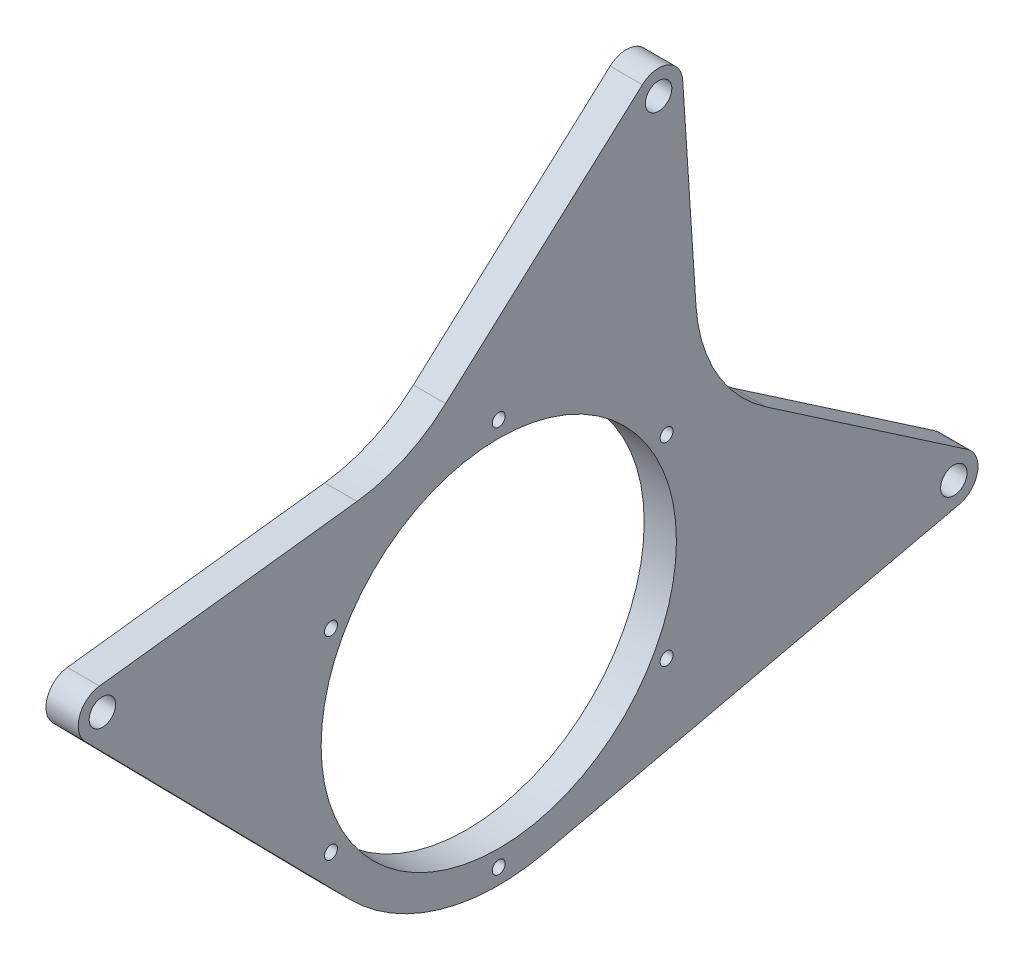
ISO-10303-21;
HEADER;
FILE_DESCRIPTION(('STEP AP214'),'2;1');
FILE_NAME('part.step','',(''),(''),'','','');
FILE_SCHEMA(('AUTOMOTIVE_DESIGN { 1 0 10303 214 1 1 1 1 }'));
ENDSEC;
DATA;
#1=APPLICATION_CONTEXT('core data for automotive mechanical design processes');
#2=APPLICATION_PROTOCOL_DEFINITION('international standard','automotive_design',2000,#1);
#3=PRODUCT_CONTEXT('',#1,'mechanical');
#4=PRODUCT('Part','Part','',(#3));
#5=PRODUCT_RELATED_PRODUCT_CATEGORY('part','',(#4));
#6=PRODUCT_DEFINITION_FORMATION('','',#4);
#7=PRODUCT_DEFINITION_CONTEXT('part definition',#1,'design');
#8=PRODUCT_DEFINITION('design','',#6,#7);
#9=PRODUCT_DEFINITION_SHAPE('','',#8);
#10=(LENGTH_UNIT() NAMED_UNIT(*) SI_UNIT(.MILLI.,.METRE.));
#11=(NAMED_UNIT(*) PLANE_ANGLE_UNIT() SI_UNIT($,.RADIAN.));
#12=(NAMED_UNIT(*) SI_UNIT($,.STERADIAN.) SOLID_ANGLE_UNIT());
#13=UNCERTAINTY_MEASURE_WITH_UNIT(LENGTH_MEASURE(1.E-05),#10,'distance_accuracy_value','');
#14=(GEOMETRIC_REPRESENTATION_CONTEXT(3) GLOBAL_UNCERTAINTY_ASSIGNED_CONTEXT((#13)) GLOBAL_UNIT_ASSIGNED_CONTEXT((#10,
#11,#12)) REPRESENTATION_CONTEXT('',''));
#15=CARTESIAN_POINT('',(0.,0.,0.));
#16=DIRECTION('',(0.,0.,1.));
#17=DIRECTION('',(1.,0.,0.));
#18=AXIS2_PLACEMENT_3D('',#15,#16,#17);
#19=CARTESIAN_POINT('',(-8.35,-19.0009562450486,-4.33392395499701));
#20=DIRECTION('',(0.,0.97496040935678,0.222378506575748));
#21=DIRECTION('',(0.,-0.222378506575748,0.97496040935678));
#22=AXIS2_PLACEMENT_3D('',#19,#20,#21);
#23=PLANE('',#22);
#24=DIRECTION('',(0.,-0.222378506575748,0.97496040935678));
#25=VECTOR('',#24,1.);
#26=CARTESIAN_POINT('',(1.65,-19.0009562450486,-4.33392395499701));
#27=LINE('',#26,#25);
#28=CARTESIAN_POINT('',(1.65,266.919395505318,-1257.87693707447));
#29=VERTEX_POINT('',#28);
#30=CARTESIAN_POINT('',(1.65,237.627573391809,-1129.45460292742));
#31=VERTEX_POINT('',#30);
#32=EDGE_CURVE('E167',#29,#31,#27,.T.);
#33=ORIENTED_EDGE('',*,*,#32,.T.);
#34=DIRECTION('',(1.,0.,0.));
#35=VECTOR('',#34,1.);
#36=CARTESIAN_POINT('',(-8.35,237.627573391809,-1129.45460292742));
#37=LINE('',#36,#35);
#38=CARTESIAN_POINT('',(-8.35,237.627573391809,-1129.45460292742));
#39=VERTEX_POINT('',#38);
#40=EDGE_CURVE('E146',#39,#31,#37,.T.);
#41=ORIENTED_EDGE('',*,*,#40,.F.);
#42=DIRECTION('',(0.,-0.222378506575748,0.97496040935678));
#43=VECTOR('',#42,1.);
#44=CARTESIAN_POINT('',(-8.35,-19.0009562450486,-4.33392395499701));
#45=LINE('',#44,#43);
#46=CARTESIAN_POINT('',(-8.35,266.919395505318,-1257.87693707447));
#47=VERTEX_POINT('',#46);
#48=EDGE_CURVE('E153',#47,#39,#45,.T.);
#49=ORIENTED_EDGE('',*,*,#48,.F.);
#50=DIRECTION('',(1.,0.,0.));
#51=VECTOR('',#50,1.);
#52=CARTESIAN_POINT('',(-8.35,266.919395505318,-1257.87693707447));
#53=LINE('',#52,#51);
#54=EDGE_CURVE('E234',#47,#29,#53,.T.);
#55=ORIENTED_EDGE('',*,*,#54,.T.);
#56=EDGE_LOOP('',(#33,#41,#49,#55));
#57=FACE_BOUND('',#56,.T.);
#58=ADVANCED_FACE('F52',(#57),#23,.F.);
#59=CARTESIAN_POINT('',(-8.35,301.,-1115.));
#60=DIRECTION('',(1.,0.,0.));
#61=DIRECTION('',(0.,0.,-1.));
#62=AXIS2_PLACEMENT_3D('',#59,#60,#61);
#63=CYLINDRICAL_SURFACE('',#62,64.9999999999999);
#64=CARTESIAN_POINT('',(1.65,301.,-1115.));
#65=DIRECTION('',(-1.,0.,0.));
#66=DIRECTION('',(0.,0.,1.));
#67=AXIS2_PLACEMENT_3D('',#64,#65,#66);
#68=CIRCLE('',#67,64.9999999999999);
#69=CARTESIAN_POINT('',(1.65,255.416880135259,-1068.66233515382));
#70=VERTEX_POINT('',#69);
#71=EDGE_CURVE('E251',#31,#70,#68,.T.);
#72=ORIENTED_EDGE('',*,*,#71,.T.);
#73=DIRECTION('',(1.,0.,0.));
#74=VECTOR('',#73,1.);
#75=CARTESIAN_POINT('',(-8.35,255.416880135259,-1068.66233515382));
#76=LINE('',#75,#74);
#77=CARTESIAN_POINT('',(-8.35,255.416880135259,-1068.66233515382));
#78=VERTEX_POINT('',#77);
#79=EDGE_CURVE('E148',#78,#70,#76,.T.);
#80=ORIENTED_EDGE('',*,*,#79,.F.);
#81=CARTESIAN_POINT('',(-8.35,301.,-1115.));
#82=DIRECTION('',(-1.,0.,0.));
#83=DIRECTION('',(0.,0.,1.));
#84=AXIS2_PLACEMENT_3D('',#81,#82,#83);
#85=CIRCLE('',#84,64.9999999999999);
#86=EDGE_CURVE('E141',#39,#78,#85,.T.);
#87=ORIENTED_EDGE('',*,*,#86,.F.);
#88=ORIENTED_EDGE('',*,*,#40,.T.);
#89=EDGE_LOOP('',(#72,#80,#87,#88));
#90=FACE_BOUND('',#89,.T.);
#91=ADVANCED_FACE('F144',(#90),#63,.T.);
#92=CARTESIAN_POINT('',(-8.35,659.871119138972,-670.794075768932));
#93=DIRECTION('',(0.,-0.701278767149864,0.712887151479648));
#94=DIRECTION('',(0.,-0.712887151479648,-0.701278767149864));
#95=AXIS2_PLACEMENT_3D('',#92,#93,#94);
#96=PLANE('',#95);
#97=DIRECTION('',(0.,-0.712887151479648,-0.701278767149864));
#98=VECTOR('',#97,1.);
#99=CARTESIAN_POINT('',(1.65,659.871119138972,-670.794075768932));
#100=LINE('',#99,#98);
#101=CARTESIAN_POINT('',(1.65,338.79410160127,-986.642796778492));
#102=VERTEX_POINT('',#101);
#103=EDGE_CURVE('E221',#102,#70,#100,.T.);
#104=ORIENTED_EDGE('',*,*,#103,.F.);
#105=DIRECTION('',(1.,0.,0.));
#106=VECTOR('',#105,1.);
#107=CARTESIAN_POINT('',(-8.35,338.79410160127,-986.642796778492));
#108=LINE('',#107,#106);
#109=CARTESIAN_POINT('',(-8.35,338.79410160127,-986.642796778492));
#110=VERTEX_POINT('',#109);
#111=EDGE_CURVE('E173',#110,#102,#108,.T.);
#112=ORIENTED_EDGE('',*,*,#111,.F.);
#113=DIRECTION('',(0.,-0.712887151479648,-0.701278767149864));
#114=VECTOR('',#113,1.);
#115=CARTESIAN_POINT('',(-8.35,659.871119138972,-670.794075768932));
#116=LINE('',#115,#114);
#117=EDGE_CURVE('E152',#110,#78,#116,.T.);
#118=ORIENTED_EDGE('',*,*,#117,.T.);
#119=ORIENTED_EDGE('',*,*,#79,.T.);
#120=EDGE_LOOP('',(#104,#112,#118,#119));
#121=FACE_BOUND('',#120,.T.);
#122=ADVANCED_FACE('F250',(#121),#96,.T.);
#123=CARTESIAN_POINT('',(-8.35,344.053692354894,-991.989450414589));
#124=DIRECTION('',(1.,0.,0.));
#125=DIRECTION('',(0.,0.,-1.));
#126=AXIS2_PLACEMENT_3D('',#123,#124,#125);
#127=CYLINDRICAL_SURFACE('',#126,7.49999999999996);
#128=CARTESIAN_POINT('',(1.65,344.053692354894,-991.989450414589));
#129=DIRECTION('',(-1.,0.,0.));
#130=DIRECTION('',(0.,0.,1.));
#131=AXIS2_PLACEMENT_3D('',#128,#129,#130);
#132=CIRCLE('',#131,7.49999999999996);
#133=CARTESIAN_POINT('',(1.65,351.499526146942,-991.089695369476));
#134=VERTEX_POINT('',#133);
#135=EDGE_CURVE('E217',#102,#134,#132,.T.);
#136=ORIENTED_EDGE('',*,*,#135,.T.);
#137=DIRECTION('',(1.,0.,0.));
#138=VECTOR('',#137,1.);
#139=CARTESIAN_POINT('',(-8.35,351.499526146942,-991.089695369476));
#140=LINE('',#139,#138);
#141=CARTESIAN_POINT('',(-8.35,351.499526146942,-991.089695369476));
#142=VERTEX_POINT('',#141);
#143=EDGE_CURVE('E216',#142,#134,#140,.T.);
#144=ORIENTED_EDGE('',*,*,#143,.F.);
#145=CARTESIAN_POINT('',(-8.35,344.053692354894,-991.989450414589));
#146=DIRECTION('',(-1.,0.,0.));
#147=DIRECTION('',(0.,0.,1.));
#148=AXIS2_PLACEMENT_3D('',#145,#146,#147);
#149=CIRCLE('',#148,7.49999999999996);
#150=EDGE_CURVE('E246',#110,#142,#149,.T.);
#151=ORIENTED_EDGE('',*,*,#150,.F.);
#152=ORIENTED_EDGE('',*,*,#111,.T.);
#153=EDGE_LOOP('',(#136,#144,#151,#152));
#154=FACE_BOUND('',#153,.T.);
#155=ADVANCED_FACE('F245',(#154),#127,.T.);
#156=CARTESIAN_POINT('',(-8.35,228.400997385236,27.59999154501));
#157=DIRECTION('',(0.,-0.992777838939653,-0.119967339348313));
#158=DIRECTION('',(0.,0.119967339348313,-0.992777838939653));
#159=AXIS2_PLACEMENT_3D('',#156,#157,#158);
#160=PLANE('',#159);
#161=DIRECTION('',(0.,0.119967339348313,-0.992777838939653));
#162=VECTOR('',#161,1.);
#163=CARTESIAN_POINT('',(1.65,228.400997385236,27.59999154501));
#164=LINE('',#163,#162);
#165=CARTESIAN_POINT('',(1.65,361.152191982604,-1070.96937579243));
#166=VERTEX_POINT('',#165);
#167=EDGE_CURVE('E209',#134,#166,#164,.T.);
#168=ORIENTED_EDGE('',*,*,#167,.T.);
#169=DIRECTION('',(1.,0.,0.));
#170=VECTOR('',#169,1.);
#171=CARTESIAN_POINT('',(-8.35,361.152191982604,-1070.96937579243));
#172=LINE('',#171,#170);
#173=CARTESIAN_POINT('',(-8.35,361.152191982604,-1070.96937579243));
#174=VERTEX_POINT('',#173);
#175=EDGE_CURVE('E171',#166,#174,#172,.F.);
#176=ORIENTED_EDGE('',*,*,#175,.T.);
#177=DIRECTION('',(0.,0.119967339348313,-0.992777838939653));
#178=VECTOR('',#177,1.);
#179=CARTESIAN_POINT('',(-8.35,228.400997385236,27.59999154501));
#180=LINE('',#179,#178);
#181=EDGE_CURVE('E191',#142,#174,#180,.T.);
#182=ORIENTED_EDGE('',*,*,#181,.F.);
#183=ORIENTED_EDGE('',*,*,#143,.T.);
#184=EDGE_LOOP('',(#168,#176,#182,#183));
#185=FACE_BOUND('',#184,.T.);
#186=ADVANCED_FACE('F214',(#185),#160,.F.);
#187=CARTESIAN_POINT('',(-8.35,-340.747289203833,-307.941373698596));
#188=DIRECTION('',(0.,0.741918898688854,0.670489632856705));
#189=DIRECTION('',(0.,-0.670489632856705,0.741918898688854));
#190=AXIS2_PLACEMENT_3D('',#187,#188,#189);
#191=PLANE('',#190);
#192=DIRECTION('',(0.,-0.670489632856705,0.741918898688854));
#193=VECTOR('',#192,1.);
#194=CARTESIAN_POINT('',(-8.35,-340.747289203833,-307.941373698596));
#195=LINE('',#194,#193);
#196=CARTESIAN_POINT('',(-8.35,428.883221767175,-1159.56292474946));
#197=VERTEX_POINT('',#196);
#198=CARTESIAN_POINT('',(-8.35,373.695138995144,-1098.49549046785));
#199=VERTEX_POINT('',#198);
#200=EDGE_CURVE('E189',#197,#199,#195,.T.);
#201=ORIENTED_EDGE('',*,*,#200,.T.);
#202=DIRECTION('',(1.,0.,0.));
#203=VECTOR('',#202,1.);
#204=CARTESIAN_POINT('',(-8.35,373.695138995144,-1098.49549046785));
#205=LINE('',#204,#203);
#206=CARTESIAN_POINT('',(1.65,373.695138995144,-1098.49549046785));
#207=VERTEX_POINT('',#206);
#208=EDGE_CURVE('E168',#199,#207,#205,.T.);
#209=ORIENTED_EDGE('',*,*,#208,.T.);
#210=DIRECTION('',(0.,-0.670489632856705,0.741918898688854));
#211=VECTOR('',#210,1.);
#212=CARTESIAN_POINT('',(1.65,-340.747289203833,-307.941373698596));
#213=LINE('',#212,#211);
#214=CARTESIAN_POINT('',(1.65,428.883221767175,-1159.56292474946));
#215=VERTEX_POINT('',#214);
#216=EDGE_CURVE('E211',#215,#207,#213,.T.);
#217=ORIENTED_EDGE('',*,*,#216,.F.);
#218=DIRECTION('',(1.,0.,0.));
#219=VECTOR('',#218,1.);
#220=CARTESIAN_POINT('',(-8.35,428.883221767175,-1159.56292474946));
#221=LINE('',#220,#219);
#222=EDGE_CURVE('E199',#197,#215,#221,.T.);
#223=ORIENTED_EDGE('',*,*,#222,.F.);
#224=EDGE_LOOP('',(#201,#209,#217,#223));
#225=FACE_BOUND('',#224,.T.);
#226=ADVANCED_FACE('F196',(#225),#191,.T.);
#227=CARTESIAN_POINT('',(-8.35,423.318830027009,-1164.59159699588));
#228=DIRECTION('',(1.,0.,0.));
#229=DIRECTION('',(0.,0.,-1.));
#230=AXIS2_PLACEMENT_3D('',#227,#228,#229);
#231=CYLINDRICAL_SURFACE('',#230,7.49999999999996);
#232=CARTESIAN_POINT('',(1.65,423.318830027009,-1164.59159699588));
#233=DIRECTION('',(-1.,0.,0.));
#234=DIRECTION('',(0.,0.,1.));
#235=AXIS2_PLACEMENT_3D('',#232,#233,#234);
#236=CIRCLE('',#235,7.49999999999996);
#237=CARTESIAN_POINT('',(1.65,423.810269894414,-1172.07547879992));
#238=VERTEX_POINT('',#237);
#239=EDGE_CURVE('E219',#215,#238,#236,.T.);
#240=ORIENTED_EDGE('',*,*,#239,.T.);
#241=DIRECTION('',(1.,0.,0.));
#242=VECTOR('',#241,1.);
#243=CARTESIAN_POINT('',(-8.35,423.810269894414,-1172.07547879992));
#244=LINE('',#243,#242);
#245=CARTESIAN_POINT('',(-8.35,423.810269894414,-1172.07547879992));
#246=VERTEX_POINT('',#245);
#247=EDGE_CURVE('E239',#246,#238,#244,.T.);
#248=ORIENTED_EDGE('',*,*,#247,.F.);
#249=CARTESIAN_POINT('',(-8.35,423.318830027009,-1164.59159699588));
#250=DIRECTION('',(-1.,0.,0.));
#251=DIRECTION('',(0.,0.,1.));
#252=AXIS2_PLACEMENT_3D('',#249,#250,#251);
#253=CIRCLE('',#252,7.49999999999996);
#254=EDGE_CURVE('E201',#197,#246,#253,.T.);
#255=ORIENTED_EDGE('',*,*,#254,.F.);
#256=ORIENTED_EDGE('',*,*,#222,.T.);
#257=EDGE_LOOP('',(#240,#248,#255,#256));
#258=FACE_BOUND('',#257,.T.);
#259=ADVANCED_FACE('F376',(#258),#231,.T.);
#260=CARTESIAN_POINT('',(-8.35,78.4552218542279,-1194.75371496942));
#261=DIRECTION('',(0.,-0.0655253156539962,0.9978509072043));
#262=DIRECTION('',(0.,-0.9978509072043,-0.0655253156539962));
#263=AXIS2_PLACEMENT_3D('',#260,#261,#262);
#264=PLANE('',#263);
#265=DIRECTION('',(0.,-0.9978509072043,-0.0655253156539962));
#266=VECTOR('',#265,1.);
#267=CARTESIAN_POINT('',(1.65,78.4552218542279,-1194.75371496942));
#268=LINE('',#267,#266);
#269=CARTESIAN_POINT('',(1.65,361.136538293917,-1176.19103956825));
#270=VERTEX_POINT('',#269);
#271=EDGE_CURVE('E226',#238,#270,#268,.T.);
#272=ORIENTED_EDGE('',*,*,#271,.T.);
#273=DIRECTION('',(1.,0.,0.));
#274=VECTOR('',#273,1.);
#275=CARTESIAN_POINT('',(-8.35,361.136538293917,-1176.19103956825));
#276=LINE('',#275,#274);
#277=CARTESIAN_POINT('',(-8.35,361.136538293917,-1176.19103956825));
#278=VERTEX_POINT('',#277);
#279=EDGE_CURVE('E67',#270,#278,#276,.F.);
#280=ORIENTED_EDGE('',*,*,#279,.T.);
#281=DIRECTION('',(0.,-0.9978509072043,-0.0655253156539962));
#282=VECTOR('',#281,1.);
#283=CARTESIAN_POINT('',(-8.35,78.4552218542279,-1194.75371496942));
#284=LINE('',#283,#282);
#285=EDGE_CURVE('E262',#246,#278,#284,.T.);
#286=ORIENTED_EDGE('',*,*,#285,.F.);
#287=ORIENTED_EDGE('',*,*,#247,.T.);
#288=EDGE_LOOP('',(#272,#280,#286,#287));
#289=FACE_BOUND('',#288,.T.);
#290=ADVANCED_FACE('F379',(#289),#264,.F.);
#291=CARTESIAN_POINT('',(-8.35,778.200036446859,-531.183906803591));
#292=DIRECTION('',(0.,0.825934305877909,-0.563766372156035));
#293=DIRECTION('',(0.,0.563766372156035,0.825934305877909));
#294=AXIS2_PLACEMENT_3D('',#291,#292,#293);
#295=PLANE('',#294);
#296=DIRECTION('',(0.,0.563766372156035,0.825934305877909));
#297=VECTOR('',#296,1.);
#298=CARTESIAN_POINT('',(-8.35,778.200036446859,-531.183906803591));
#299=LINE('',#298,#297);
#300=CARTESIAN_POINT('',(-8.35,280.426105869579,-1260.43734606633));
#301=VERTEX_POINT('',#300);
#302=CARTESIAN_POINT('',(-8.35,323.116088782721,-1197.89526632066));
#303=VERTEX_POINT('',#302);
#304=EDGE_CURVE('E259',#301,#303,#299,.T.);
#305=ORIENTED_EDGE('',*,*,#304,.T.);
#306=DIRECTION('',(1.,0.,0.));
#307=VECTOR('',#306,1.);
#308=CARTESIAN_POINT('',(-8.35,323.116088782722,-1197.89526632066));
#309=LINE('',#308,#307);
#310=CARTESIAN_POINT('',(1.65,323.116088782721,-1197.89526632066));
#311=VERTEX_POINT('',#310);
#312=EDGE_CURVE('E178',#303,#311,#309,.T.);
#313=ORIENTED_EDGE('',*,*,#312,.T.);
#314=DIRECTION('',(0.,0.563766372156035,0.825934305877909));
#315=VECTOR('',#314,1.);
#316=CARTESIAN_POINT('',(1.65,778.200036446859,-531.183906803591));
#317=LINE('',#316,#315);
#318=CARTESIAN_POINT('',(1.65,280.426105869579,-1260.43734606633));
#319=VERTEX_POINT('',#318);
#320=EDGE_CURVE('E228',#319,#311,#317,.T.);
#321=ORIENTED_EDGE('',*,*,#320,.F.);
#322=DIRECTION('',(1.,0.,0.));
#323=VECTOR('',#322,1.);
#324=CARTESIAN_POINT('',(-8.35,280.426105869579,-1260.43734606633));
#325=LINE('',#324,#323);
#326=EDGE_CURVE('E236',#301,#319,#325,.T.);
#327=ORIENTED_EDGE('',*,*,#326,.F.);
#328=EDGE_LOOP('',(#305,#313,#321,#327));
#329=FACE_BOUND('',#328,.T.);
#330=ADVANCED_FACE('F383',(#329),#295,.T.);
#331=CARTESIAN_POINT('',(-8.35,274.231598575494,-1256.20909827516));
#332=DIRECTION('',(1.,0.,0.));
#333=DIRECTION('',(0.,0.,-1.));
#334=AXIS2_PLACEMENT_3D('',#331,#332,#333);
#335=CYLINDRICAL_SURFACE('',#334,7.49999999999996);
#336=CARTESIAN_POINT('',(1.65,274.231598575494,-1256.20909827516));
#337=DIRECTION('',(-1.,0.,0.));
#338=DIRECTION('',(0.,0.,1.));
#339=AXIS2_PLACEMENT_3D('',#336,#337,#338);
#340=CIRCLE('',#339,7.49999999999996);
#341=EDGE_CURVE('E230',#319,#29,#340,.T.);
#342=ORIENTED_EDGE('',*,*,#341,.T.);
#343=ORIENTED_EDGE('',*,*,#54,.F.);
#344=CARTESIAN_POINT('',(-8.35,274.231598575494,-1256.20909827516));
#345=DIRECTION('',(-1.,0.,0.));
#346=DIRECTION('',(0.,0.,1.));
#347=AXIS2_PLACEMENT_3D('',#344,#345,#346);
#348=CIRCLE('',#347,7.49999999999996);
#349=EDGE_CURVE('E160',#301,#47,#348,.T.);
#350=ORIENTED_EDGE('',*,*,#349,.F.);
#351=ORIENTED_EDGE('',*,*,#326,.T.);
#352=EDGE_LOOP('',(#342,#343,#350,#351));
#353=FACE_BOUND('',#352,.T.);
#354=ADVANCED_FACE('F386',(#353),#335,.T.);
#355=CARTESIAN_POINT('',(-8.35,301.,-1115.));
#356=DIRECTION('',(1.,0.,0.));
#357=DIRECTION('',(0.,0.,-1.));
#358=AXIS2_PLACEMENT_3D('',#355,#356,#357);
#359=CYLINDRICAL_SURFACE('',#358,55.1250000000001);
#360=CARTESIAN_POINT('',(-8.35,301.,-1115.));
#361=DIRECTION('',(-1.,0.,0.));
#362=DIRECTION('',(0.,0.,1.));
#363=AXIS2_PLACEMENT_3D('',#360,#361,#362);
#364=CIRCLE('',#363,55.1250000000001);
#365=CARTESIAN_POINT('',(-8.35,301.,-1059.875));
#366=VERTEX_POINT('',#365);
#367=EDGE_CURVE('E237',#366,#366,#364,.T.);
#368=ORIENTED_EDGE('',*,*,#367,.T.);
#369=EDGE_LOOP('',(#368));
#370=FACE_BOUND('',#369,.T.);
#371=CARTESIAN_POINT('',(1.65,301.,-1115.));
#372=DIRECTION('',(-1.,0.,0.));
#373=DIRECTION('',(0.,0.,1.));
#374=AXIS2_PLACEMENT_3D('',#371,#372,#373);
#375=CIRCLE('',#374,55.1250000000001);
#376=CARTESIAN_POINT('',(1.65,301.,-1059.875));
#377=VERTEX_POINT('',#376);
#378=EDGE_CURVE('E164',#377,#377,#375,.T.);
#379=ORIENTED_EDGE('',*,*,#378,.F.);
#380=EDGE_LOOP('',(#379));
#381=FACE_BOUND('',#380,.T.);
#382=ADVANCED_FACE('F327',(#370,#381),#359,.F.);
#383=CARTESIAN_POINT('',(-8.35,0.,0.));
#384=DIRECTION('',(-1.,0.,0.));
#385=DIRECTION('',(0.,0.,1.));
#386=AXIS2_PLACEMENT_3D('',#383,#384,#385);
#387=PLANE('',#386);
#388=CARTESIAN_POINT('',(-8.35,423.318830027009,-1164.59159699588));
#389=DIRECTION('',(-1.,0.,0.));
#390=DIRECTION('',(0.,0.,1.));
#391=AXIS2_PLACEMENT_3D('',#388,#389,#390);
#392=CIRCLE('',#391,4.09999999999999);
#393=CARTESIAN_POINT('',(-8.35,423.318830027009,-1160.49159699588));
#394=VERTEX_POINT('',#393);
#395=EDGE_CURVE('E297',#394,#394,#392,.T.);
#396=ORIENTED_EDGE('',*,*,#395,.F.);
#397=EDGE_LOOP('',(#396));
#398=FACE_BOUND('',#397,.T.);
#399=CARTESIAN_POINT('',(-8.35,344.053692354894,-991.989450414589));
#400=DIRECTION('',(-1.,0.,0.));
#401=DIRECTION('',(0.,0.,1.));
#402=AXIS2_PLACEMENT_3D('',#399,#400,#401);
#403=CIRCLE('',#402,4.09999999999999);
#404=CARTESIAN_POINT('',(-8.35,344.053692354894,-987.889450414589));
#405=VERTEX_POINT('',#404);
#406=EDGE_CURVE('E313',#405,#405,#403,.T.);
#407=ORIENTED_EDGE('',*,*,#406,.F.);
#408=EDGE_LOOP('',(#407));
#409=FACE_BOUND('',#408,.T.);
#410=CARTESIAN_POINT('',(-8.35,274.231598575494,-1256.20909827516));
#411=DIRECTION('',(-1.,0.,0.));
#412=DIRECTION('',(0.,0.,1.));
#413=AXIS2_PLACEMENT_3D('',#410,#411,#412);
#414=CIRCLE('',#413,4.09999999999999);
#415=CARTESIAN_POINT('',(-8.35,274.231598575494,-1252.10909827516));
#416=VERTEX_POINT('',#415);
#417=EDGE_CURVE('E307',#416,#416,#414,.T.);
#418=ORIENTED_EDGE('',*,*,#417,.F.);
#419=EDGE_LOOP('',(#418));
#420=FACE_BOUND('',#419,.T.);
#421=CARTESIAN_POINT('',(-8.35,361.125,-1115.));
#422=DIRECTION('',(-1.,0.,0.));
#423=DIRECTION('',(0.,0.,1.));
#424=AXIS2_PLACEMENT_3D('',#421,#422,#423);
#425=CIRCLE('',#424,2.0000000000001);
#426=CARTESIAN_POINT('',(-8.35,361.125,-1113.));
#427=VERTEX_POINT('',#426);
#428=EDGE_CURVE('E255',#427,#427,#425,.T.);
#429=ORIENTED_EDGE('',*,*,#428,.F.);
#430=EDGE_LOOP('',(#429));
#431=FACE_BOUND('',#430,.T.);
#432=CARTESIAN_POINT('',(-8.35,331.0625,-1167.06977740254));
#433=DIRECTION('',(-1.,0.,0.));
#434=DIRECTION('',(0.,0.,1.));
#435=AXIS2_PLACEMENT_3D('',#432,#433,#434);
#436=CIRCLE('',#435,2.00000000000012);
#437=CARTESIAN_POINT('',(-8.35,331.0625,-1165.06977740254));
#438=VERTEX_POINT('',#437);
#439=EDGE_CURVE('E272',#438,#438,#436,.T.);
#440=ORIENTED_EDGE('',*,*,#439,.F.);
#441=EDGE_LOOP('',(#440));
#442=FACE_BOUND('',#441,.T.);
#443=CARTESIAN_POINT('',(-8.35,270.937500000001,-1167.06977740254));
#444=DIRECTION('',(-1.,0.,0.));
#445=DIRECTION('',(0.,0.,1.));
#446=AXIS2_PLACEMENT_3D('',#443,#444,#445);
#447=CIRCLE('',#446,2.0000000000001);
#448=CARTESIAN_POINT('',(-8.35,270.937500000001,-1165.06977740254));
#449=VERTEX_POINT('',#448);
#450=EDGE_CURVE('E271',#449,#449,#447,.T.);
#451=ORIENTED_EDGE('',*,*,#450,.F.);
#452=EDGE_LOOP('',(#451));
#453=FACE_BOUND('',#452,.T.);
#454=CARTESIAN_POINT('',(-8.35,240.875000000002,-1115.));
#455=DIRECTION('',(-1.,0.,0.));
#456=DIRECTION('',(0.,0.,1.));
#457=AXIS2_PLACEMENT_3D('',#454,#455,#456);
#458=CIRCLE('',#457,2.0000000000001);
#459=CARTESIAN_POINT('',(-8.35,240.875000000002,-1113.));
#460=VERTEX_POINT('',#459);
#461=EDGE_CURVE('E278',#460,#460,#458,.T.);
#462=ORIENTED_EDGE('',*,*,#461,.F.);
#463=EDGE_LOOP('',(#462));
#464=FACE_BOUND('',#463,.T.);
#465=CARTESIAN_POINT('',(-8.35,270.937500000001,-1062.93022259746));
#466=DIRECTION('',(-1.,0.,0.));
#467=DIRECTION('',(0.,0.,1.));
#468=AXIS2_PLACEMENT_3D('',#465,#466,#467);
#469=CIRCLE('',#468,2.0000000000001);
#470=CARTESIAN_POINT('',(-8.35,270.937500000001,-1060.93022259746));
#471=VERTEX_POINT('',#470);
#472=EDGE_CURVE('E284',#471,#471,#469,.T.);
#473=ORIENTED_EDGE('',*,*,#472,.F.);
#474=EDGE_LOOP('',(#473));
#475=FACE_BOUND('',#474,.T.);
#476=CARTESIAN_POINT('',(-8.35,331.062500000001,-1062.93022259746));
#477=DIRECTION('',(-1.,0.,0.));
#478=DIRECTION('',(0.,0.,1.));
#479=AXIS2_PLACEMENT_3D('',#476,#477,#478);
#480=CIRCLE('',#479,2.0000000000001);
#481=CARTESIAN_POINT('',(-8.35,331.062500000001,-1060.93022259746));
#482=VERTEX_POINT('',#481);
#483=EDGE_CURVE('E290',#482,#482,#480,.T.);
#484=ORIENTED_EDGE('',*,*,#483,.F.);
#485=EDGE_LOOP('',(#484));
#486=FACE_BOUND('',#485,.T.);
#487=ORIENTED_EDGE('',*,*,#48,.T.);
#488=ORIENTED_EDGE('',*,*,#86,.T.);
#489=ORIENTED_EDGE('',*,*,#117,.F.);
#490=ORIENTED_EDGE('',*,*,#150,.T.);
#491=ORIENTED_EDGE('',*,*,#181,.T.);
#492=CARTESIAN_POINT('',(-8.35,410.791083929587,-1064.97100882502));
#493=DIRECTION('',(-1.,0.,0.));
#494=DIRECTION('',(0.,0.,1.));
#495=AXIS2_PLACEMENT_3D('',#492,#493,#494);
#496=CIRCLE('',#495,50.);
#497=EDGE_CURVE('E184',#174,#199,#496,.F.);
#498=ORIENTED_EDGE('',*,*,#497,.T.);
#499=ORIENTED_EDGE('',*,*,#200,.F.);
#500=ORIENTED_EDGE('',*,*,#254,.T.);
#501=ORIENTED_EDGE('',*,*,#285,.T.);
#502=CARTESIAN_POINT('',(-8.35,364.412804076617,-1226.08358492847));
#503=DIRECTION('',(-1.,0.,0.));
#504=DIRECTION('',(0.,0.,1.));
#505=AXIS2_PLACEMENT_3D('',#502,#503,#504);
#506=CIRCLE('',#505,50.);
#507=EDGE_CURVE('E12',#278,#303,#506,.F.);
#508=ORIENTED_EDGE('',*,*,#507,.T.);
#509=ORIENTED_EDGE('',*,*,#304,.F.);
#510=ORIENTED_EDGE('',*,*,#349,.T.);
#511=EDGE_LOOP('',(#487,#488,#489,#490,#491,#498,#499,#500,#501,#508,#509,#510));
#512=FACE_BOUND('',#511,.T.);
#513=ORIENTED_EDGE('',*,*,#367,.F.);
#514=EDGE_LOOP('',(#513));
#515=FACE_BOUND('',#514,.T.);
#516=ADVANCED_FACE('F156',(#398,#409,#420,#431,#442,#453,#464,#475,#486,#512,#515),#387,.T.);
#517=CARTESIAN_POINT('',(1.65,0.,0.));
#518=DIRECTION('',(-1.,0.,0.));
#519=DIRECTION('',(0.,0.,1.));
#520=AXIS2_PLACEMENT_3D('',#517,#518,#519);
#521=PLANE('',#520);
#522=CARTESIAN_POINT('',(1.65,423.318830027009,-1164.59159699588));
#523=DIRECTION('',(-1.,0.,0.));
#524=DIRECTION('',(0.,0.,1.));
#525=AXIS2_PLACEMENT_3D('',#522,#523,#524);
#526=CIRCLE('',#525,4.09999999999999);
#527=CARTESIAN_POINT('',(1.65,423.318830027009,-1160.49159699588));
#528=VERTEX_POINT('',#527);
#529=EDGE_CURVE('E316',#528,#528,#526,.T.);
#530=ORIENTED_EDGE('',*,*,#529,.T.);
#531=EDGE_LOOP('',(#530));
#532=FACE_BOUND('',#531,.T.);
#533=CARTESIAN_POINT('',(1.65,344.053692354894,-991.989450414589));
#534=DIRECTION('',(-1.,0.,0.));
#535=DIRECTION('',(0.,0.,1.));
#536=AXIS2_PLACEMENT_3D('',#533,#534,#535);
#537=CIRCLE('',#536,4.09999999999999);
#538=CARTESIAN_POINT('',(1.65,344.053692354894,-987.889450414589));
#539=VERTEX_POINT('',#538);
#540=EDGE_CURVE('E310',#539,#539,#537,.T.);
#541=ORIENTED_EDGE('',*,*,#540,.T.);
#542=EDGE_LOOP('',(#541));
#543=FACE_BOUND('',#542,.T.);
#544=CARTESIAN_POINT('',(1.65,274.231598575494,-1256.20909827516));
#545=DIRECTION('',(-1.,0.,0.));
#546=DIRECTION('',(0.,0.,1.));
#547=AXIS2_PLACEMENT_3D('',#544,#545,#546);
#548=CIRCLE('',#547,4.09999999999999);
#549=CARTESIAN_POINT('',(1.65,274.231598575494,-1252.10909827516));
#550=VERTEX_POINT('',#549);
#551=EDGE_CURVE('E304',#550,#550,#548,.T.);
#552=ORIENTED_EDGE('',*,*,#551,.T.);
#553=EDGE_LOOP('',(#552));
#554=FACE_BOUND('',#553,.T.);
#555=CARTESIAN_POINT('',(1.65,361.125,-1115.));
#556=DIRECTION('',(-1.,0.,0.));
#557=DIRECTION('',(0.,0.,1.));
#558=AXIS2_PLACEMENT_3D('',#555,#556,#557);
#559=CIRCLE('',#558,2.0000000000001);
#560=CARTESIAN_POINT('',(1.65,361.125,-1113.));
#561=VERTEX_POINT('',#560);
#562=EDGE_CURVE('E293',#561,#561,#559,.T.);
#563=ORIENTED_EDGE('',*,*,#562,.T.);
#564=EDGE_LOOP('',(#563));
#565=FACE_BOUND('',#564,.T.);
#566=CARTESIAN_POINT('',(1.65,331.0625,-1167.06977740254));
#567=DIRECTION('',(-1.,0.,0.));
#568=DIRECTION('',(0.,0.,1.));
#569=AXIS2_PLACEMENT_3D('',#566,#567,#568);
#570=CIRCLE('',#569,2.00000000000012);
#571=CARTESIAN_POINT('',(1.65,331.0625,-1165.06977740254));
#572=VERTEX_POINT('',#571);
#573=EDGE_CURVE('E294',#572,#572,#570,.T.);
#574=ORIENTED_EDGE('',*,*,#573,.T.);
#575=EDGE_LOOP('',(#574));
#576=FACE_BOUND('',#575,.T.);
#577=CARTESIAN_POINT('',(1.65,270.937500000001,-1167.06977740254));
#578=DIRECTION('',(-1.,0.,0.));
#579=DIRECTION('',(0.,0.,1.));
#580=AXIS2_PLACEMENT_3D('',#577,#578,#579);
#581=CIRCLE('',#580,2.0000000000001);
#582=CARTESIAN_POINT('',(1.65,270.937500000001,-1165.06977740254));
#583=VERTEX_POINT('',#582);
#584=EDGE_CURVE('E268',#583,#583,#581,.T.);
#585=ORIENTED_EDGE('',*,*,#584,.T.);
#586=EDGE_LOOP('',(#585));
#587=FACE_BOUND('',#586,.T.);
#588=CARTESIAN_POINT('',(1.65,240.875000000002,-1115.));
#589=DIRECTION('',(-1.,0.,0.));
#590=DIRECTION('',(0.,0.,1.));
#591=AXIS2_PLACEMENT_3D('',#588,#589,#590);
#592=CIRCLE('',#591,2.0000000000001);
#593=CARTESIAN_POINT('',(1.65,240.875000000002,-1113.));
#594=VERTEX_POINT('',#593);
#595=EDGE_CURVE('E275',#594,#594,#592,.T.);
#596=ORIENTED_EDGE('',*,*,#595,.T.);
#597=EDGE_LOOP('',(#596));
#598=FACE_BOUND('',#597,.T.);
#599=CARTESIAN_POINT('',(1.65,270.937500000001,-1062.93022259746));
#600=DIRECTION('',(-1.,0.,0.));
#601=DIRECTION('',(0.,0.,1.));
#602=AXIS2_PLACEMENT_3D('',#599,#600,#601);
#603=CIRCLE('',#602,2.0000000000001);
#604=CARTESIAN_POINT('',(1.65,270.937500000001,-1060.93022259746));
#605=VERTEX_POINT('',#604);
#606=EDGE_CURVE('E281',#605,#605,#603,.T.);
#607=ORIENTED_EDGE('',*,*,#606,.T.);
#608=EDGE_LOOP('',(#607));
#609=FACE_BOUND('',#608,.T.);
#610=CARTESIAN_POINT('',(1.65,331.062500000001,-1062.93022259746));
#611=DIRECTION('',(-1.,0.,0.));
#612=DIRECTION('',(0.,0.,1.));
#613=AXIS2_PLACEMENT_3D('',#610,#611,#612);
#614=CIRCLE('',#613,2.0000000000001);
#615=CARTESIAN_POINT('',(1.65,331.062500000001,-1060.93022259746));
#616=VERTEX_POINT('',#615);
#617=EDGE_CURVE('E287',#616,#616,#614,.T.);
#618=ORIENTED_EDGE('',*,*,#617,.T.);
#619=EDGE_LOOP('',(#618));
#620=FACE_BOUND('',#619,.T.);
#621=ORIENTED_EDGE('',*,*,#32,.F.);
#622=ORIENTED_EDGE('',*,*,#341,.F.);
#623=ORIENTED_EDGE('',*,*,#320,.T.);
#624=CARTESIAN_POINT('',(1.65,364.412804076617,-1226.08358492847));
#625=DIRECTION('',(-1.,0.,0.));
#626=DIRECTION('',(0.,0.,1.));
#627=AXIS2_PLACEMENT_3D('',#624,#625,#626);
#628=CIRCLE('',#627,50.);
#629=EDGE_CURVE('E60',#311,#270,#628,.T.);
#630=ORIENTED_EDGE('',*,*,#629,.T.);
#631=ORIENTED_EDGE('',*,*,#271,.F.);
#632=ORIENTED_EDGE('',*,*,#239,.F.);
#633=ORIENTED_EDGE('',*,*,#216,.T.);
#634=CARTESIAN_POINT('',(1.65,410.791083929587,-1064.97100882502));
#635=DIRECTION('',(-1.,0.,0.));
#636=DIRECTION('',(0.,0.,1.));
#637=AXIS2_PLACEMENT_3D('',#634,#635,#636);
#638=CIRCLE('',#637,50.);
#639=EDGE_CURVE('E182',#207,#166,#638,.T.);
#640=ORIENTED_EDGE('',*,*,#639,.T.);
#641=ORIENTED_EDGE('',*,*,#167,.F.);
#642=ORIENTED_EDGE('',*,*,#135,.F.);
#643=ORIENTED_EDGE('',*,*,#103,.T.);
#644=ORIENTED_EDGE('',*,*,#71,.F.);
#645=EDGE_LOOP('',(#621,#622,#623,#630,#631,#632,#633,#640,#641,#642,#643,#644));
#646=FACE_BOUND('',#645,.T.);
#647=ORIENTED_EDGE('',*,*,#378,.T.);
#648=EDGE_LOOP('',(#647));
#649=FACE_BOUND('',#648,.T.);
#650=ADVANCED_FACE('F206',(#532,#543,#554,#565,#576,#587,#598,#609,#620,#646,#649),#521,.F.);
#651=CARTESIAN_POINT('',(-8.35,410.791083929587,-1064.97100882502));
#652=DIRECTION('',(1.,0.,0.));
#653=DIRECTION('',(0.,0.,-1.));
#654=AXIS2_PLACEMENT_3D('',#651,#652,#653);
#655=CYLINDRICAL_SURFACE('',#654,50.);
#656=ORIENTED_EDGE('',*,*,#497,.F.);
#657=ORIENTED_EDGE('',*,*,#175,.F.);
#658=ORIENTED_EDGE('',*,*,#639,.F.);
#659=ORIENTED_EDGE('',*,*,#208,.F.);
#660=EDGE_LOOP('',(#656,#657,#658,#659));
#661=FACE_BOUND('',#660,.T.);
#662=ADVANCED_FACE('F203',(#661),#655,.F.);
#663=CARTESIAN_POINT('',(-8.35,364.412804076617,-1226.08358492847));
#664=DIRECTION('',(1.,0.,0.));
#665=DIRECTION('',(0.,0.,-1.));
#666=AXIS2_PLACEMENT_3D('',#663,#664,#665);
#667=CYLINDRICAL_SURFACE('',#666,50.);
#668=ORIENTED_EDGE('',*,*,#507,.F.);
#669=ORIENTED_EDGE('',*,*,#279,.F.);
#670=ORIENTED_EDGE('',*,*,#629,.F.);
#671=ORIENTED_EDGE('',*,*,#312,.F.);
#672=EDGE_LOOP('',(#668,#669,#670,#671));
#673=FACE_BOUND('',#672,.T.);
#674=ADVANCED_FACE('F54',(#673),#667,.F.);
#675=CARTESIAN_POINT('',(-8.35,331.062500000001,-1062.93022259746));
#676=DIRECTION('',(1.,0.,0.));
#677=DIRECTION('',(0.,0.,-1.));
#678=AXIS2_PLACEMENT_3D('',#675,#676,#677);
#679=CYLINDRICAL_SURFACE('',#678,2.0000000000001);
#680=ORIENTED_EDGE('',*,*,#483,.T.);
#681=EDGE_LOOP('',(#680));
#682=FACE_BOUND('',#681,.T.);
#683=ORIENTED_EDGE('',*,*,#617,.F.);
#684=EDGE_LOOP('',(#683));
#685=FACE_BOUND('',#684,.T.);
#686=ADVANCED_FACE('F345',(#682,#685),#679,.F.);
#687=CARTESIAN_POINT('',(-8.35,270.937500000001,-1062.93022259746));
#688=DIRECTION('',(1.,0.,0.));
#689=DIRECTION('',(0.,0.,-1.));
#690=AXIS2_PLACEMENT_3D('',#687,#688,#689);
#691=CYLINDRICAL_SURFACE('',#690,2.0000000000001);
#692=ORIENTED_EDGE('',*,*,#472,.T.);
#693=EDGE_LOOP('',(#692));
#694=FACE_BOUND('',#693,.T.);
#695=ORIENTED_EDGE('',*,*,#606,.F.);
#696=EDGE_LOOP('',(#695));
#697=FACE_BOUND('',#696,.T.);
#698=ADVANCED_FACE('F348',(#694,#697),#691,.F.);
#699=CARTESIAN_POINT('',(-8.35,240.875000000002,-1115.));
#700=DIRECTION('',(1.,0.,0.));
#701=DIRECTION('',(0.,0.,-1.));
#702=AXIS2_PLACEMENT_3D('',#699,#700,#701);
#703=CYLINDRICAL_SURFACE('',#702,2.0000000000001);
#704=ORIENTED_EDGE('',*,*,#461,.T.);
#705=EDGE_LOOP('',(#704));
#706=FACE_BOUND('',#705,.T.);
#707=ORIENTED_EDGE('',*,*,#595,.F.);
#708=EDGE_LOOP('',(#707));
#709=FACE_BOUND('',#708,.T.);
#710=ADVANCED_FACE('F435',(#706,#709),#703,.F.);
#711=CARTESIAN_POINT('',(-8.35,270.937500000001,-1167.06977740254));
#712=DIRECTION('',(1.,0.,0.));
#713=DIRECTION('',(0.,0.,-1.));
#714=AXIS2_PLACEMENT_3D('',#711,#712,#713);
#715=CYLINDRICAL_SURFACE('',#714,2.0000000000001);
#716=ORIENTED_EDGE('',*,*,#450,.T.);
#717=EDGE_LOOP('',(#716));
#718=FACE_BOUND('',#717,.T.);
#719=ORIENTED_EDGE('',*,*,#584,.F.);
#720=EDGE_LOOP('',(#719));
#721=FACE_BOUND('',#720,.T.);
#722=ADVANCED_FACE('F443',(#718,#721),#715,.F.);
#723=CARTESIAN_POINT('',(-8.35,331.0625,-1167.06977740254));
#724=DIRECTION('',(1.,0.,0.));
#725=DIRECTION('',(0.,0.,-1.));
#726=AXIS2_PLACEMENT_3D('',#723,#724,#725);
#727=CYLINDRICAL_SURFACE('',#726,2.00000000000012);
#728=ORIENTED_EDGE('',*,*,#439,.T.);
#729=EDGE_LOOP('',(#728));
#730=FACE_BOUND('',#729,.T.);
#731=ORIENTED_EDGE('',*,*,#573,.F.);
#732=EDGE_LOOP('',(#731));
#733=FACE_BOUND('',#732,.T.);
#734=ADVANCED_FACE('F451',(#730,#733),#727,.F.);
#735=CARTESIAN_POINT('',(-8.35,361.125,-1115.));
#736=DIRECTION('',(1.,0.,0.));
#737=DIRECTION('',(0.,0.,-1.));
#738=AXIS2_PLACEMENT_3D('',#735,#736,#737);
#739=CYLINDRICAL_SURFACE('',#738,2.0000000000001);
#740=ORIENTED_EDGE('',*,*,#428,.T.);
#741=EDGE_LOOP('',(#740));
#742=FACE_BOUND('',#741,.T.);
#743=ORIENTED_EDGE('',*,*,#562,.F.);
#744=EDGE_LOOP('',(#743));
#745=FACE_BOUND('',#744,.T.);
#746=ADVANCED_FACE('F459',(#742,#745),#739,.F.);
#747=CARTESIAN_POINT('',(-8.35,274.231598575494,-1256.20909827516));
#748=DIRECTION('',(1.,0.,0.));
#749=DIRECTION('',(0.,0.,-1.));
#750=AXIS2_PLACEMENT_3D('',#747,#748,#749);
#751=CYLINDRICAL_SURFACE('',#750,4.09999999999999);
#752=ORIENTED_EDGE('',*,*,#417,.T.);
#753=EDGE_LOOP('',(#752));
#754=FACE_BOUND('',#753,.T.);
#755=ORIENTED_EDGE('',*,*,#551,.F.);
#756=EDGE_LOOP('',(#755));
#757=FACE_BOUND('',#756,.T.);
#758=ADVANCED_FACE('F466',(#754,#757),#751,.F.);
#759=CARTESIAN_POINT('',(-8.35,344.053692354894,-991.989450414589));
#760=DIRECTION('',(1.,0.,0.));
#761=DIRECTION('',(0.,0.,-1.));
#762=AXIS2_PLACEMENT_3D('',#759,#760,#761);
#763=CYLINDRICAL_SURFACE('',#762,4.09999999999999);
#764=ORIENTED_EDGE('',*,*,#406,.T.);
#765=EDGE_LOOP('',(#764));
#766=FACE_BOUND('',#765,.T.);
#767=ORIENTED_EDGE('',*,*,#540,.F.);
#768=EDGE_LOOP('',(#767));
#769=FACE_BOUND('',#768,.T.);
#770=ADVANCED_FACE('F473',(#766,#769),#763,.F.);
#771=CARTESIAN_POINT('',(-8.35,423.318830027009,-1164.59159699588));
#772=DIRECTION('',(1.,0.,0.));
#773=DIRECTION('',(0.,0.,-1.));
#774=AXIS2_PLACEMENT_3D('',#771,#772,#773);
#775=CYLINDRICAL_SURFACE('',#774,4.09999999999999);
#776=ORIENTED_EDGE('',*,*,#395,.T.);
#777=EDGE_LOOP('',(#776));
#778=FACE_BOUND('',#777,.T.);
#779=ORIENTED_EDGE('',*,*,#529,.F.);
#780=EDGE_LOOP('',(#779));
#781=FACE_BOUND('',#780,.T.);
#782=ADVANCED_FACE('F322',(#778,#781),#775,.F.);
#783=CLOSED_SHELL('',(#58,#91,#122,#155,#186,#226,#259,#290,#330,#354,#382,#516,#650,#662,#674,
#686,#698,#710,#722,#734,#746,#758,#770,#782));
#784=MANIFOLD_SOLID_BREP('B2',#783);
#785=ADVANCED_BREP_SHAPE_REPRESENTATION('',(#18,#784),#14);
#786=SHAPE_DEFINITION_REPRESENTATION(#9,#785);
ENDSEC;
END-ISO-10303-21;
